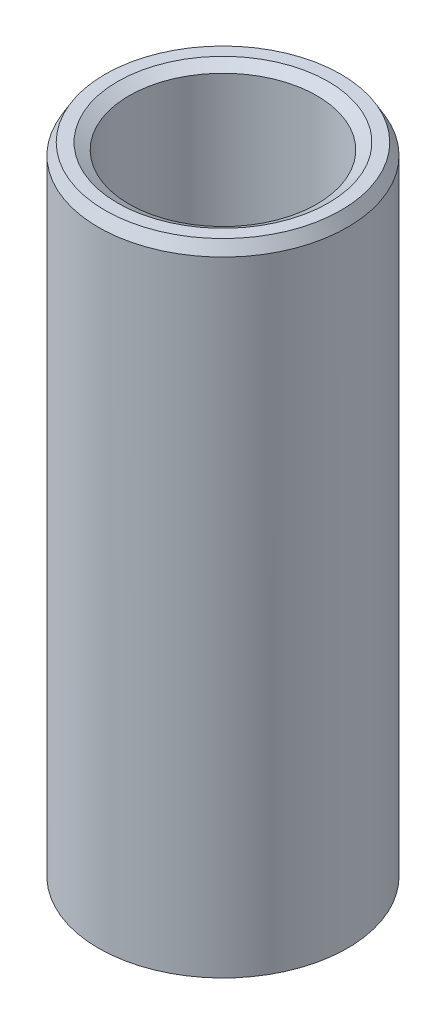
ISO-10303-21;
HEADER;
FILE_DESCRIPTION(('STEP AP214'),'2;1');
FILE_NAME('part.step','',(''),(''),'','','');
FILE_SCHEMA(('AUTOMOTIVE_DESIGN { 1 0 10303 214 1 1 1 1 }'));
ENDSEC;
DATA;
#1=APPLICATION_CONTEXT('core data for automotive mechanical design processes');
#2=APPLICATION_PROTOCOL_DEFINITION('international standard','automotive_design',2000,#1);
#3=PRODUCT_CONTEXT('',#1,'mechanical');
#4=PRODUCT('Part','Part','',(#3));
#5=PRODUCT_RELATED_PRODUCT_CATEGORY('part','',(#4));
#6=PRODUCT_DEFINITION_FORMATION('','',#4);
#7=PRODUCT_DEFINITION_CONTEXT('part definition',#1,'design');
#8=PRODUCT_DEFINITION('design','',#6,#7);
#9=PRODUCT_DEFINITION_SHAPE('','',#8);
#10=(LENGTH_UNIT() NAMED_UNIT(*) SI_UNIT(.MILLI.,.METRE.));
#11=(NAMED_UNIT(*) PLANE_ANGLE_UNIT() SI_UNIT($,.RADIAN.));
#12=(NAMED_UNIT(*) SI_UNIT($,.STERADIAN.) SOLID_ANGLE_UNIT());
#13=UNCERTAINTY_MEASURE_WITH_UNIT(LENGTH_MEASURE(1.E-05),#10,'distance_accuracy_value','');
#14=(GEOMETRIC_REPRESENTATION_CONTEXT(3) GLOBAL_UNCERTAINTY_ASSIGNED_CONTEXT((#13)) GLOBAL_UNIT_ASSIGNED_CONTEXT((#10,
#11,#12)) REPRESENTATION_CONTEXT('',''));
#15=CARTESIAN_POINT('',(0.,0.,0.));
#16=DIRECTION('',(0.,0.,1.));
#17=DIRECTION('',(1.,0.,0.));
#18=AXIS2_PLACEMENT_3D('',#15,#16,#17);
#19=CARTESIAN_POINT('',(0.,219.236649232269,0.));
#20=DIRECTION('',(0.,-1.,0.));
#21=DIRECTION('',(0.,0.,-1.));
#22=AXIS2_PLACEMENT_3D('',#19,#20,#21);
#23=CYLINDRICAL_SURFACE('',#22,42.5);
#24=CARTESIAN_POINT('',(0.,2.24746694056213,0.));
#25=DIRECTION('',(0.,1.,0.));
#26=DIRECTION('',(0.,0.,1.));
#27=AXIS2_PLACEMENT_3D('',#24,#25,#26);
#28=CIRCLE('',#27,42.5);
#29=CARTESIAN_POINT('',(0.,2.24746694056213,42.5));
#30=VERTEX_POINT('',#29);
#31=EDGE_CURVE('E10',#30,#30,#28,.T.);
#32=ORIENTED_EDGE('',*,*,#31,.T.);
#33=EDGE_LOOP('',(#32));
#34=FACE_BOUND('',#33,.T.);
#35=CARTESIAN_POINT('',(0.,215.343922302884,0.));
#36=DIRECTION('',(0.,1.,0.));
#37=DIRECTION('',(0.,0.,1.));
#38=AXIS2_PLACEMENT_3D('',#35,#36,#37);
#39=CIRCLE('',#38,42.5);
#40=CARTESIAN_POINT('',(0.,215.343922302884,-42.5));
#41=VERTEX_POINT('',#40);
#42=EDGE_CURVE('E50',#41,#41,#39,.F.);
#43=ORIENTED_EDGE('',*,*,#42,.T.);
#44=EDGE_LOOP('',(#43));
#45=FACE_BOUND('',#44,.T.);
#46=ADVANCED_FACE('F39',(#34,#45),#23,.T.);
#47=CARTESIAN_POINT('',(0.,219.236649232269,0.));
#48=DIRECTION('',(0.,1.,0.));
#49=DIRECTION('',(0.,0.,1.));
#50=AXIS2_PLACEMENT_3D('',#47,#48,#49);
#51=PLANE('',#50);
#52=CARTESIAN_POINT('',(0.,219.236649232269,0.));
#53=DIRECTION('',(0.,1.,0.));
#54=DIRECTION('',(0.,0.,1.));
#55=AXIS2_PLACEMENT_3D('',#52,#53,#54);
#56=CIRCLE('',#55,35.9530498744922);
#57=CARTESIAN_POINT('',(0.,219.236649232269,35.9530498744922));
#58=VERTEX_POINT('',#57);
#59=EDGE_CURVE('E58',#58,#58,#56,.F.);
#60=ORIENTED_EDGE('',*,*,#59,.T.);
#61=EDGE_LOOP('',(#60));
#62=FACE_BOUND('',#61,.T.);
#63=CARTESIAN_POINT('',(0.,219.236649232269,0.));
#64=DIRECTION('',(0.,1.,0.));
#65=DIRECTION('',(0.,0.,1.));
#66=AXIS2_PLACEMENT_3D('',#63,#64,#65);
#67=CIRCLE('',#66,40.2525330594379);
#68=CARTESIAN_POINT('',(0.,219.236649232269,-40.2525330594379));
#69=VERTEX_POINT('',#68);
#70=EDGE_CURVE('E61',#69,#69,#67,.T.);
#71=ORIENTED_EDGE('',*,*,#70,.T.);
#72=EDGE_LOOP('',(#71));
#73=FACE_BOUND('',#72,.T.);
#74=ADVANCED_FACE('F88',(#62,#73),#51,.T.);
#75=CARTESIAN_POINT('',(0.,0.,0.));
#76=DIRECTION('',(0.,1.,0.));
#77=DIRECTION('',(0.,0.,1.));
#78=AXIS2_PLACEMENT_3D('',#75,#76,#77);
#79=PLANE('',#78);
#80=CARTESIAN_POINT('',(0.,0.,0.));
#81=DIRECTION('',(0.,1.,0.));
#82=DIRECTION('',(0.,0.,1.));
#83=AXIS2_PLACEMENT_3D('',#80,#81,#82);
#84=CIRCLE('',#83,34.3077898856692);
#85=CARTESIAN_POINT('',(0.,0.,34.3077898856692));
#86=VERTEX_POINT('',#85);
#87=EDGE_CURVE('E51',#86,#86,#84,.T.);
#88=ORIENTED_EDGE('',*,*,#87,.T.);
#89=EDGE_LOOP('',(#88));
#90=FACE_BOUND('',#89,.T.);
#91=CARTESIAN_POINT('',(0.,0.,0.));
#92=DIRECTION('',(0.,1.,0.));
#93=DIRECTION('',(0.,0.,1.));
#94=AXIS2_PLACEMENT_3D('',#91,#92,#93);
#95=CIRCLE('',#94,38.607273070615);
#96=CARTESIAN_POINT('',(0.,0.,38.607273070615));
#97=VERTEX_POINT('',#96);
#98=EDGE_CURVE('E54',#97,#97,#95,.F.);
#99=ORIENTED_EDGE('',*,*,#98,.T.);
#100=EDGE_LOOP('',(#99));
#101=FACE_BOUND('',#100,.T.);
#102=ADVANCED_FACE('F83',(#90,#101),#79,.F.);
#103=CARTESIAN_POINT('',(0.,219.236649232269,0.));
#104=DIRECTION('',(0.,-1.,0.));
#105=DIRECTION('',(0.,0.,-1.));
#106=AXIS2_PLACEMENT_3D('',#103,#104,#105);
#107=CYLINDRICAL_SURFACE('',#106,32.0603229451071);
#108=CARTESIAN_POINT('',(0.,216.989182291706,0.));
#109=DIRECTION('',(0.,1.,0.));
#110=DIRECTION('',(0.,0.,1.));
#111=AXIS2_PLACEMENT_3D('',#108,#109,#110);
#112=CIRCLE('',#111,32.0603229451071);
#113=CARTESIAN_POINT('',(0.,216.989182291706,32.0603229451071));
#114=VERTEX_POINT('',#113);
#115=EDGE_CURVE('E67',#114,#114,#112,.T.);
#116=ORIENTED_EDGE('',*,*,#115,.T.);
#117=EDGE_LOOP('',(#116));
#118=FACE_BOUND('',#117,.T.);
#119=CARTESIAN_POINT('',(0.,3.89272692938503,0.));
#120=DIRECTION('',(0.,1.,0.));
#121=DIRECTION('',(0.,0.,1.));
#122=AXIS2_PLACEMENT_3D('',#119,#120,#121);
#123=CIRCLE('',#122,32.0603229451071);
#124=CARTESIAN_POINT('',(0.,3.89272692938503,32.0603229451071));
#125=VERTEX_POINT('',#124);
#126=EDGE_CURVE('E69',#125,#125,#123,.F.);
#127=ORIENTED_EDGE('',*,*,#126,.T.);
#128=EDGE_LOOP('',(#127));
#129=FACE_BOUND('',#128,.T.);
#130=ADVANCED_FACE('F71',(#118,#129),#107,.F.);
#131=CARTESIAN_POINT('',(0.,216.989182291706,0.));
#132=DIRECTION('',(0.,1.,0.));
#133=DIRECTION('',(0.,0.,1.));
#134=AXIS2_PLACEMENT_3D('',#131,#132,#133);
#135=CONICAL_SURFACE('',#134,32.0603229451071,1.0471975511966);
#136=ORIENTED_EDGE('',*,*,#59,.F.);
#137=EDGE_LOOP('',(#136));
#138=FACE_BOUND('',#137,.T.);
#139=ORIENTED_EDGE('',*,*,#115,.F.);
#140=EDGE_LOOP('',(#139));
#141=FACE_BOUND('',#140,.T.);
#142=ADVANCED_FACE('F77',(#138,#141),#135,.F.);
#143=CARTESIAN_POINT('',(0.,0.,0.));
#144=DIRECTION('',(0.,-1.,0.));
#145=DIRECTION('',(0.,0.,-1.));
#146=AXIS2_PLACEMENT_3D('',#143,#144,#145);
#147=CONICAL_SURFACE('',#146,34.3077898856692,0.523598775598295);
#148=ORIENTED_EDGE('',*,*,#126,.F.);
#149=EDGE_LOOP('',(#148));
#150=FACE_BOUND('',#149,.T.);
#151=ORIENTED_EDGE('',*,*,#87,.F.);
#152=EDGE_LOOP('',(#151));
#153=FACE_BOUND('',#152,.T.);
#154=ADVANCED_FACE('F73',(#150,#153),#147,.F.);
#155=CARTESIAN_POINT('',(0.,2.24746694056213,0.));
#156=DIRECTION('',(0.,1.,0.));
#157=DIRECTION('',(0.,0.,1.));
#158=AXIS2_PLACEMENT_3D('',#155,#156,#157);
#159=CONICAL_SURFACE('',#158,42.5,1.0471975511966);
#160=ORIENTED_EDGE('',*,*,#98,.F.);
#161=EDGE_LOOP('',(#160));
#162=FACE_BOUND('',#161,.T.);
#163=ORIENTED_EDGE('',*,*,#31,.F.);
#164=EDGE_LOOP('',(#163));
#165=FACE_BOUND('',#164,.T.);
#166=ADVANCED_FACE('F76',(#162,#165),#159,.T.);
#167=CARTESIAN_POINT('',(0.,219.236649232269,0.));
#168=DIRECTION('',(0.,-1.,0.));
#169=DIRECTION('',(0.,0.,-1.));
#170=AXIS2_PLACEMENT_3D('',#167,#168,#169);
#171=CONICAL_SURFACE('',#170,40.2525330594379,0.523598775598298);
#172=CARTESIAN_POINT('',(0.,215.343922302884,-42.5));
#173=CARTESIAN_POINT('',(0.,215.384471541731,-42.4765888860358));
#174=CARTESIAN_POINT('',(0.,215.425020780579,-42.4531777720716));
#175=CARTESIAN_POINT('',(0.,215.506119258275,-42.4063555441433));
#176=CARTESIAN_POINT('',(0.,215.546668497122,-42.3829444301791));
#177=CARTESIAN_POINT('',(0.,215.627766974818,-42.3361222022507));
#178=CARTESIAN_POINT('',(0.,215.668316213666,-42.3127110882865));
#179=CARTESIAN_POINT('',(0.,215.749414691361,-42.2658888603581));
#180=CARTESIAN_POINT('',(0.,215.789963930209,-42.2424777463939));
#181=CARTESIAN_POINT('',(0.,215.871062407905,-42.1956555184656));
#182=CARTESIAN_POINT('',(0.,215.911611646752,-42.1722444045014));
#183=CARTESIAN_POINT('',(0.,215.992710124448,-42.125422176573));
#184=CARTESIAN_POINT('',(0.,216.033259363296,-42.1020110626088));
#185=CARTESIAN_POINT('',(0.,216.114357840991,-42.0551888346804));
#186=CARTESIAN_POINT('',(0.,216.154907079839,-42.0317777207162));
#187=CARTESIAN_POINT('',(0.,216.236005557534,-41.9849554927878));
#188=CARTESIAN_POINT('',(0.,216.276554796382,-41.9615443788237));
#189=CARTESIAN_POINT('',(0.,216.357653274078,-41.9147221508953));
#190=CARTESIAN_POINT('',(0.,216.398202512925,-41.8913110369311));
#191=CARTESIAN_POINT('',(0.,216.479300990621,-41.8444888090027));
#192=CARTESIAN_POINT('',(0.,216.519850229469,-41.8210776950385));
#193=CARTESIAN_POINT('',(0.,216.600948707164,-41.7742554671102));
#194=CARTESIAN_POINT('',(0.,216.641497946012,-41.750844353146));
#195=CARTESIAN_POINT('',(0.,216.722596423707,-41.7040221252176));
#196=CARTESIAN_POINT('',(0.,216.763145662555,-41.6806110112534));
#197=CARTESIAN_POINT('',(0.,216.844244140251,-41.633788783325));
#198=CARTESIAN_POINT('',(0.,216.884793379098,-41.6103776693608));
#199=CARTESIAN_POINT('',(0.,216.965891856794,-41.5635554414325));
#200=CARTESIAN_POINT('',(0.,217.006441095642,-41.5401443274683));
#201=CARTESIAN_POINT('',(0.,217.087539573337,-41.4933220995399));
#202=CARTESIAN_POINT('',(0.,217.128088812185,-41.4699109855757));
#203=CARTESIAN_POINT('',(0.,217.209187289881,-41.4230887576473));
#204=CARTESIAN_POINT('',(0.,217.249736528728,-41.3996776436831));
#205=CARTESIAN_POINT('',(0.,217.330835006424,-41.3528554157547));
#206=CARTESIAN_POINT('',(0.,217.371384245272,-41.3294443017906));
#207=CARTESIAN_POINT('',(0.,217.452482722967,-41.2826220738622));
#208=CARTESIAN_POINT('',(0.,217.493031961815,-41.259210959898));
#209=CARTESIAN_POINT('',(0.,217.57413043951,-41.2123887319696));
#210=CARTESIAN_POINT('',(0.,217.614679678358,-41.1889776180054));
#211=CARTESIAN_POINT('',(0.,217.695778156054,-41.142155390077));
#212=CARTESIAN_POINT('',(0.,217.736327394901,-41.1187442761129));
#213=CARTESIAN_POINT('',(0.,217.817425872597,-41.0719220481845));
#214=CARTESIAN_POINT('',(0.,217.857975111445,-41.0485109342203));
#215=CARTESIAN_POINT('',(0.,217.93907358914,-41.0016887062919));
#216=CARTESIAN_POINT('',(0.,217.979622827988,-40.9782775923277));
#217=CARTESIAN_POINT('',(0.,218.060721305684,-40.9314553643993));
#218=CARTESIAN_POINT('',(0.,218.101270544531,-40.9080442504352));
#219=CARTESIAN_POINT('',(0.,218.182369022227,-40.8612220225068));
#220=CARTESIAN_POINT('',(0.,218.222918261075,-40.8378109085426));
#221=CARTESIAN_POINT('',(0.,218.30401673877,-40.7909886806142));
#222=CARTESIAN_POINT('',(0.,218.344565977618,-40.76757756665));
#223=CARTESIAN_POINT('',(0.,218.425664455313,-40.7207553387216));
#224=CARTESIAN_POINT('',(0.,218.466213694161,-40.6973442247575));
#225=CARTESIAN_POINT('',(0.,218.547312171857,-40.6505219968291));
#226=CARTESIAN_POINT('',(0.,218.587861410704,-40.6271108828649));
#227=CARTESIAN_POINT('',(0.,218.6689598884,-40.5802886549365));
#228=CARTESIAN_POINT('',(0.,218.709509127248,-40.5568775409723));
#229=CARTESIAN_POINT('',(0.,218.790607604943,-40.5100553130439));
#230=CARTESIAN_POINT('',(0.,218.831156843791,-40.4866441990797));
#231=CARTESIAN_POINT('',(0.,218.912255321487,-40.4398219711514));
#232=CARTESIAN_POINT('',(0.,218.952804560334,-40.4164108571872));
#233=CARTESIAN_POINT('',(0.,219.03390303803,-40.3695886292588));
#234=CARTESIAN_POINT('',(0.,219.074452276878,-40.3461775152946));
#235=CARTESIAN_POINT('',(0.,219.155550754573,-40.2993552873662));
#236=CARTESIAN_POINT('',(0.,219.196099993421,-40.275944173402));
#237=CARTESIAN_POINT('',(0.,219.236649232269,-40.2525330594379));
#238=B_SPLINE_CURVE_WITH_KNOTS('',3,(#172,#173,#174,#175,#176,#177,#178,#179,#180,#181,#182,
#183,#184,#185,#186,#187,#188,#189,#190,#191,#192,#193,#194,#195,#196,#197,#198,#199,#200,#201,
#202,#203,#204,#205,#206,#207,#208,#209,#210,#211,#212,#213,#214,#215,#216,#217,#218,#219,#220,
#221,#222,#223,#224,#225,#226,#227,#228,#229,#230,#231,#232,#233,#234,#235,#236,#237),
.UNSPECIFIED.,.F.,.F.,(4,2,2,2,2,2,2,2,2,2,2,2,2,2,2,2,2,2,2,2,2,2,2,2,2,2,2,2,2,2,2,2,4),(0.,
0.140466683785125,0.280933367570249,0.421400051355401,0.561866735140526,0.702333418925675,
0.8428001027108,0.983266786495928,1.12373347028108,1.2642001540662,1.40466683785135,
1.54513352163648,1.6856002054216,1.82606688920675,1.96653357299188,2.10700025677703,
2.24746694056215,2.38793362434728,2.52840030813243,2.66886699191755,2.8093336757027,
2.94980035948783,3.09026704327295,3.2307337270581,3.37120041084323,3.51166709462838,
3.6521337784135,3.79260046219863,3.93306714598378,4.0735338297689,4.21400051355405,
4.35446719733918,4.49493388112433),.UNSPECIFIED.);
#239=EDGE_CURVE('BSEAM45',#41,#69,#238,.T.);
#240=ORIENTED_EDGE('',*,*,#42,.F.);
#241=ORIENTED_EDGE('',*,*,#70,.F.);
#242=ORIENTED_EDGE('',*,*,#239,.T.);
#243=ORIENTED_EDGE('',*,*,#239,.F.);
#244=EDGE_LOOP('',(#240,#242,#241,#243));
#245=FACE_BOUND('',#244,.T.);
#246=ADVANCED_FACE('F45',(#245),#171,.T.);
#247=CLOSED_SHELL('',(#46,#74,#102,#130,#142,#154,#166,#246));
#248=MANIFOLD_SOLID_BREP('B2',#247);
#249=ADVANCED_BREP_SHAPE_REPRESENTATION('',(#18,#248),#14);
#250=SHAPE_DEFINITION_REPRESENTATION(#9,#249);
ENDSEC;
END-ISO-10303-21;
